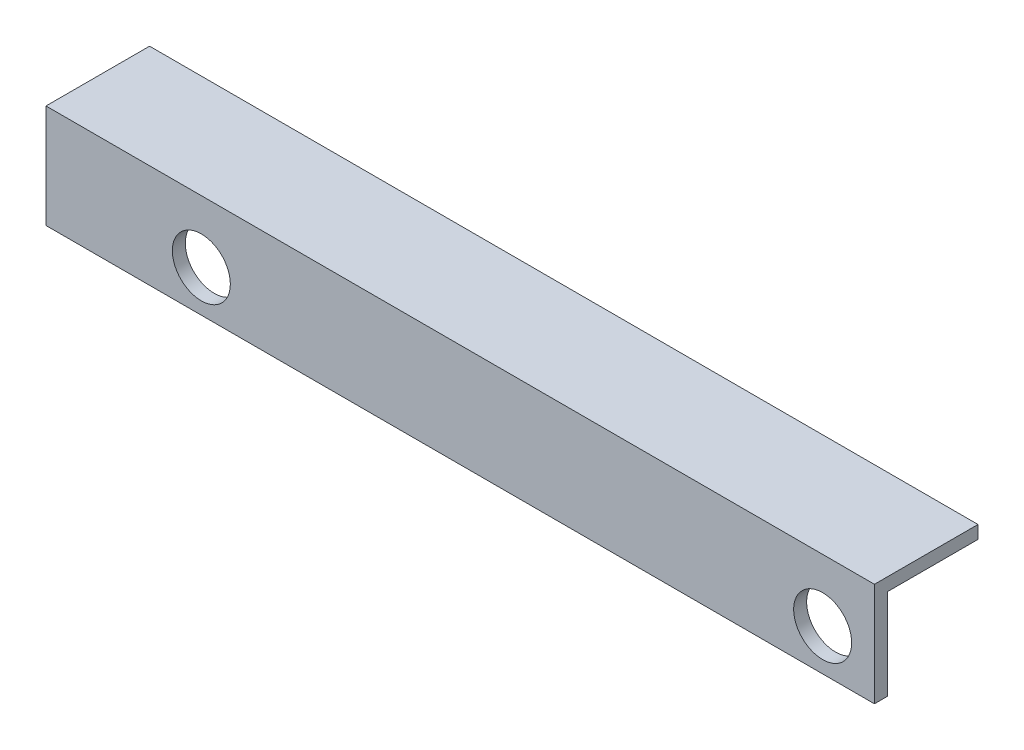
ISO-10303-21;
HEADER;
FILE_DESCRIPTION(('STEP AP214'),'2;1');
FILE_NAME('part.step','',(''),(''),'','','');
FILE_SCHEMA(('AUTOMOTIVE_DESIGN { 1 0 10303 214 1 1 1 1 }'));
ENDSEC;
DATA;
#1=APPLICATION_CONTEXT('core data for automotive mechanical design processes');
#2=APPLICATION_PROTOCOL_DEFINITION('international standard','automotive_design',2000,#1);
#3=PRODUCT_CONTEXT('',#1,'mechanical');
#4=PRODUCT('Part','Part','',(#3));
#5=PRODUCT_RELATED_PRODUCT_CATEGORY('part','',(#4));
#6=PRODUCT_DEFINITION_FORMATION('','',#4);
#7=PRODUCT_DEFINITION_CONTEXT('part definition',#1,'design');
#8=PRODUCT_DEFINITION('design','',#6,#7);
#9=PRODUCT_DEFINITION_SHAPE('','',#8);
#10=(LENGTH_UNIT() NAMED_UNIT(*) SI_UNIT(.MILLI.,.METRE.));
#11=(NAMED_UNIT(*) PLANE_ANGLE_UNIT() SI_UNIT($,.RADIAN.));
#12=(NAMED_UNIT(*) SI_UNIT($,.STERADIAN.) SOLID_ANGLE_UNIT());
#13=UNCERTAINTY_MEASURE_WITH_UNIT(LENGTH_MEASURE(1.E-05),#10,'distance_accuracy_value','');
#14=(GEOMETRIC_REPRESENTATION_CONTEXT(3) GLOBAL_UNCERTAINTY_ASSIGNED_CONTEXT((#13)) GLOBAL_UNIT_ASSIGNED_CONTEXT((#10,
#11,#12)) REPRESENTATION_CONTEXT('',''));
#15=CARTESIAN_POINT('',(0.,0.,0.));
#16=DIRECTION('',(0.,0.,1.));
#17=DIRECTION('',(1.,0.,0.));
#18=AXIS2_PLACEMENT_3D('',#15,#16,#17);
#19=CARTESIAN_POINT('',(-57.15,0.,0.));
#20=DIRECTION('',(0.,-1.,0.));
#21=DIRECTION('',(0.,0.,-1.));
#22=AXIS2_PLACEMENT_3D('',#19,#20,#21);
#23=PLANE('',#22);
#24=DIRECTION('',(1.,0.,0.));
#25=VECTOR('',#24,1.);
#26=CARTESIAN_POINT('',(-57.15,0.,-1.5875));
#27=LINE('',#26,#25);
#28=CARTESIAN_POINT('',(-57.15,0.,-1.5875));
#29=VERTEX_POINT('',#28);
#30=CARTESIAN_POINT('',(44.45,0.,-1.5875));
#31=VERTEX_POINT('',#30);
#32=EDGE_CURVE('E88',#29,#31,#27,.T.);
#33=ORIENTED_EDGE('',*,*,#32,.T.);
#34=DIRECTION('',(0.,0.,-1.));
#35=VECTOR('',#34,1.);
#36=CARTESIAN_POINT('',(44.45,0.,0.));
#37=LINE('',#36,#35);
#38=CARTESIAN_POINT('',(44.45,0.,0.));
#39=VERTEX_POINT('',#38);
#40=EDGE_CURVE('E91',#39,#31,#37,.T.);
#41=ORIENTED_EDGE('',*,*,#40,.F.);
#42=DIRECTION('',(1.,0.,0.));
#43=VECTOR('',#42,1.);
#44=CARTESIAN_POINT('',(-57.15,0.,0.));
#45=LINE('',#44,#43);
#46=CARTESIAN_POINT('',(-57.15,0.,0.));
#47=VERTEX_POINT('',#46);
#48=EDGE_CURVE('E11',#47,#39,#45,.T.);
#49=ORIENTED_EDGE('',*,*,#48,.F.);
#50=DIRECTION('',(0.,0.,-1.));
#51=VECTOR('',#50,1.);
#52=CARTESIAN_POINT('',(-57.15,0.,0.));
#53=LINE('',#52,#51);
#54=EDGE_CURVE('E92',#47,#29,#53,.T.);
#55=ORIENTED_EDGE('',*,*,#54,.T.);
#56=EDGE_LOOP('',(#33,#41,#49,#55));
#57=FACE_BOUND('',#56,.T.);
#58=ADVANCED_FACE('F38',(#57),#23,.T.);
#59=CARTESIAN_POINT('',(-57.15,0.,0.));
#60=DIRECTION('',(0.,0.,1.));
#61=DIRECTION('',(1.,0.,0.));
#62=AXIS2_PLACEMENT_3D('',#59,#60,#61);
#63=PLANE('',#62);
#64=CARTESIAN_POINT('',(-38.1,5.08,0.));
#65=DIRECTION('',(0.,0.,1.));
#66=DIRECTION('',(1.,0.,0.));
#67=AXIS2_PLACEMENT_3D('',#64,#65,#66);
#68=CIRCLE('',#67,3.556);
#69=CARTESIAN_POINT('',(-34.544,5.08,0.));
#70=VERTEX_POINT('',#69);
#71=EDGE_CURVE('E143',#70,#70,#68,.T.);
#72=ORIENTED_EDGE('',*,*,#71,.F.);
#73=EDGE_LOOP('',(#72));
#74=FACE_BOUND('',#73,.T.);
#75=CARTESIAN_POINT('',(38.1,5.08,0.));
#76=DIRECTION('',(0.,0.,1.));
#77=DIRECTION('',(1.,0.,0.));
#78=AXIS2_PLACEMENT_3D('',#75,#76,#77);
#79=CIRCLE('',#78,3.556);
#80=CARTESIAN_POINT('',(41.656,5.08,0.));
#81=VERTEX_POINT('',#80);
#82=EDGE_CURVE('E115',#81,#81,#79,.T.);
#83=ORIENTED_EDGE('',*,*,#82,.F.);
#84=EDGE_LOOP('',(#83));
#85=FACE_BOUND('',#84,.T.);
#86=ORIENTED_EDGE('',*,*,#48,.T.);
#87=DIRECTION('',(0.,-1.,0.));
#88=VECTOR('',#87,1.);
#89=CARTESIAN_POINT('',(44.45,0.,0.));
#90=LINE('',#89,#88);
#91=CARTESIAN_POINT('',(44.45,12.7,0.));
#92=VERTEX_POINT('',#91);
#93=EDGE_CURVE('E110',#92,#39,#90,.T.);
#94=ORIENTED_EDGE('',*,*,#93,.F.);
#95=DIRECTION('',(1.,0.,0.));
#96=VECTOR('',#95,1.);
#97=CARTESIAN_POINT('',(-57.15,12.7,0.));
#98=LINE('',#97,#96);
#99=CARTESIAN_POINT('',(-57.15,12.7,0.));
#100=VERTEX_POINT('',#99);
#101=EDGE_CURVE('E46',#100,#92,#98,.T.);
#102=ORIENTED_EDGE('',*,*,#101,.F.);
#103=DIRECTION('',(0.,-1.,0.));
#104=VECTOR('',#103,1.);
#105=CARTESIAN_POINT('',(-57.15,0.,0.));
#106=LINE('',#105,#104);
#107=EDGE_CURVE('E97',#100,#47,#106,.T.);
#108=ORIENTED_EDGE('',*,*,#107,.T.);
#109=EDGE_LOOP('',(#86,#94,#102,#108));
#110=FACE_BOUND('',#109,.T.);
#111=ADVANCED_FACE('F154',(#74,#85,#110),#63,.T.);
#112=CARTESIAN_POINT('',(-57.15,12.7,0.));
#113=DIRECTION('',(0.,1.,0.));
#114=DIRECTION('',(0.,0.,1.));
#115=AXIS2_PLACEMENT_3D('',#112,#113,#114);
#116=PLANE('',#115);
#117=ORIENTED_EDGE('',*,*,#101,.T.);
#118=DIRECTION('',(0.,0.,1.));
#119=VECTOR('',#118,1.);
#120=CARTESIAN_POINT('',(44.45,12.7,0.));
#121=LINE('',#120,#119);
#122=CARTESIAN_POINT('',(44.45,12.7,-12.7));
#123=VERTEX_POINT('',#122);
#124=EDGE_CURVE('E122',#123,#92,#121,.T.);
#125=ORIENTED_EDGE('',*,*,#124,.F.);
#126=DIRECTION('',(1.,0.,0.));
#127=VECTOR('',#126,1.);
#128=CARTESIAN_POINT('',(-57.15,12.7,-12.7));
#129=LINE('',#128,#127);
#130=CARTESIAN_POINT('',(-57.15,12.7,-12.7));
#131=VERTEX_POINT('',#130);
#132=EDGE_CURVE('E138',#131,#123,#129,.T.);
#133=ORIENTED_EDGE('',*,*,#132,.F.);
#134=DIRECTION('',(0.,0.,1.));
#135=VECTOR('',#134,1.);
#136=CARTESIAN_POINT('',(-57.15,12.7,0.));
#137=LINE('',#136,#135);
#138=EDGE_CURVE('E134',#131,#100,#137,.T.);
#139=ORIENTED_EDGE('',*,*,#138,.T.);
#140=EDGE_LOOP('',(#117,#125,#133,#139));
#141=FACE_BOUND('',#140,.T.);
#142=ADVANCED_FACE('F156',(#141),#116,.T.);
#143=CARTESIAN_POINT('',(-57.15,12.7,-12.7));
#144=DIRECTION('',(0.,0.,-1.));
#145=DIRECTION('',(-1.,0.,0.));
#146=AXIS2_PLACEMENT_3D('',#143,#144,#145);
#147=PLANE('',#146);
#148=ORIENTED_EDGE('',*,*,#132,.T.);
#149=DIRECTION('',(0.,1.,0.));
#150=VECTOR('',#149,1.);
#151=CARTESIAN_POINT('',(44.45,12.7,-12.7));
#152=LINE('',#151,#150);
#153=CARTESIAN_POINT('',(44.45,11.1125,-12.7));
#154=VERTEX_POINT('',#153);
#155=EDGE_CURVE('E119',#154,#123,#152,.T.);
#156=ORIENTED_EDGE('',*,*,#155,.F.);
#157=DIRECTION('',(1.,0.,0.));
#158=VECTOR('',#157,1.);
#159=CARTESIAN_POINT('',(-57.15,11.1125,-12.7));
#160=LINE('',#159,#158);
#161=CARTESIAN_POINT('',(-57.15,11.1125,-12.7));
#162=VERTEX_POINT('',#161);
#163=EDGE_CURVE('E140',#162,#154,#160,.T.);
#164=ORIENTED_EDGE('',*,*,#163,.F.);
#165=DIRECTION('',(0.,1.,0.));
#166=VECTOR('',#165,1.);
#167=CARTESIAN_POINT('',(-57.15,12.7,-12.7));
#168=LINE('',#167,#166);
#169=EDGE_CURVE('E131',#162,#131,#168,.T.);
#170=ORIENTED_EDGE('',*,*,#169,.T.);
#171=EDGE_LOOP('',(#148,#156,#164,#170));
#172=FACE_BOUND('',#171,.T.);
#173=ADVANCED_FACE('F170',(#172),#147,.T.);
#174=CARTESIAN_POINT('',(-57.15,11.1125,-1.5875));
#175=DIRECTION('',(0.,-1.,0.));
#176=DIRECTION('',(0.,0.,-1.));
#177=AXIS2_PLACEMENT_3D('',#174,#175,#176);
#178=PLANE('',#177);
#179=ORIENTED_EDGE('',*,*,#163,.T.);
#180=DIRECTION('',(0.,0.,-1.));
#181=VECTOR('',#180,1.);
#182=CARTESIAN_POINT('',(44.45,11.1125,-1.5875));
#183=LINE('',#182,#181);
#184=CARTESIAN_POINT('',(44.45,11.1125,-1.5875));
#185=VERTEX_POINT('',#184);
#186=EDGE_CURVE('E105',#185,#154,#183,.T.);
#187=ORIENTED_EDGE('',*,*,#186,.F.);
#188=DIRECTION('',(1.,0.,0.));
#189=VECTOR('',#188,1.);
#190=CARTESIAN_POINT('',(-57.15,11.1125,-1.5875));
#191=LINE('',#190,#189);
#192=CARTESIAN_POINT('',(-57.15,11.1125,-1.5875));
#193=VERTEX_POINT('',#192);
#194=EDGE_CURVE('E96',#193,#185,#191,.T.);
#195=ORIENTED_EDGE('',*,*,#194,.F.);
#196=DIRECTION('',(0.,0.,-1.));
#197=VECTOR('',#196,1.);
#198=CARTESIAN_POINT('',(-57.15,11.1125,-1.5875));
#199=LINE('',#198,#197);
#200=EDGE_CURVE('E128',#193,#162,#199,.T.);
#201=ORIENTED_EDGE('',*,*,#200,.T.);
#202=EDGE_LOOP('',(#179,#187,#195,#201));
#203=FACE_BOUND('',#202,.T.);
#204=ADVANCED_FACE('F166',(#203),#178,.T.);
#205=CARTESIAN_POINT('',(-57.15,0.,-1.5875));
#206=DIRECTION('',(0.,0.,-1.));
#207=DIRECTION('',(-1.,0.,0.));
#208=AXIS2_PLACEMENT_3D('',#205,#206,#207);
#209=PLANE('',#208);
#210=CARTESIAN_POINT('',(-38.1,5.08,-1.5875));
#211=DIRECTION('',(0.,0.,-1.));
#212=DIRECTION('',(-1.,0.,0.));
#213=AXIS2_PLACEMENT_3D('',#210,#211,#212);
#214=CIRCLE('',#213,3.556);
#215=CARTESIAN_POINT('',(-41.656,5.08,-1.5875));
#216=VERTEX_POINT('',#215);
#217=EDGE_CURVE('E41',#216,#216,#214,.T.);
#218=ORIENTED_EDGE('',*,*,#217,.F.);
#219=EDGE_LOOP('',(#218));
#220=FACE_BOUND('',#219,.T.);
#221=CARTESIAN_POINT('',(38.1,5.08,-1.5875));
#222=DIRECTION('',(0.,0.,-1.));
#223=DIRECTION('',(-1.,0.,0.));
#224=AXIS2_PLACEMENT_3D('',#221,#222,#223);
#225=CIRCLE('',#224,3.556);
#226=CARTESIAN_POINT('',(34.544,5.08,-1.5875));
#227=VERTEX_POINT('',#226);
#228=EDGE_CURVE('E113',#227,#227,#225,.T.);
#229=ORIENTED_EDGE('',*,*,#228,.F.);
#230=EDGE_LOOP('',(#229));
#231=FACE_BOUND('',#230,.T.);
#232=ORIENTED_EDGE('',*,*,#194,.T.);
#233=DIRECTION('',(0.,1.,0.));
#234=VECTOR('',#233,1.);
#235=CARTESIAN_POINT('',(44.45,0.,-1.5875));
#236=LINE('',#235,#234);
#237=EDGE_CURVE('E100',#31,#185,#236,.T.);
#238=ORIENTED_EDGE('',*,*,#237,.F.);
#239=ORIENTED_EDGE('',*,*,#32,.F.);
#240=DIRECTION('',(0.,1.,0.));
#241=VECTOR('',#240,1.);
#242=CARTESIAN_POINT('',(-57.15,0.,-1.5875));
#243=LINE('',#242,#241);
#244=EDGE_CURVE('E126',#29,#193,#243,.T.);
#245=ORIENTED_EDGE('',*,*,#244,.T.);
#246=EDGE_LOOP('',(#232,#238,#239,#245));
#247=FACE_BOUND('',#246,.T.);
#248=ADVANCED_FACE('F101',(#220,#231,#247),#209,.T.);
#249=CARTESIAN_POINT('',(-57.15,0.,0.));
#250=DIRECTION('',(1.,0.,0.));
#251=DIRECTION('',(0.,0.,-1.));
#252=AXIS2_PLACEMENT_3D('',#249,#250,#251);
#253=PLANE('',#252);
#254=ORIENTED_EDGE('',*,*,#54,.F.);
#255=ORIENTED_EDGE('',*,*,#107,.F.);
#256=ORIENTED_EDGE('',*,*,#138,.F.);
#257=ORIENTED_EDGE('',*,*,#169,.F.);
#258=ORIENTED_EDGE('',*,*,#200,.F.);
#259=ORIENTED_EDGE('',*,*,#244,.F.);
#260=EDGE_LOOP('',(#254,#255,#256,#257,#258,#259));
#261=FACE_BOUND('',#260,.T.);
#262=ADVANCED_FACE('F162',(#261),#253,.F.);
#263=CARTESIAN_POINT('',(44.45,0.,0.));
#264=DIRECTION('',(1.,0.,0.));
#265=DIRECTION('',(0.,0.,-1.));
#266=AXIS2_PLACEMENT_3D('',#263,#264,#265);
#267=PLANE('',#266);
#268=ORIENTED_EDGE('',*,*,#40,.T.);
#269=ORIENTED_EDGE('',*,*,#237,.T.);
#270=ORIENTED_EDGE('',*,*,#186,.T.);
#271=ORIENTED_EDGE('',*,*,#155,.T.);
#272=ORIENTED_EDGE('',*,*,#124,.T.);
#273=ORIENTED_EDGE('',*,*,#93,.T.);
#274=EDGE_LOOP('',(#268,#269,#270,#271,#272,#273));
#275=FACE_BOUND('',#274,.T.);
#276=ADVANCED_FACE('F108',(#275),#267,.T.);
#277=CARTESIAN_POINT('',(38.1,5.08,-12.7));
#278=DIRECTION('',(0.,0.,1.));
#279=DIRECTION('',(1.,0.,0.));
#280=AXIS2_PLACEMENT_3D('',#277,#278,#279);
#281=CYLINDRICAL_SURFACE('',#280,3.556);
#282=ORIENTED_EDGE('',*,*,#228,.T.);
#283=EDGE_LOOP('',(#282));
#284=FACE_BOUND('',#283,.T.);
#285=ORIENTED_EDGE('',*,*,#82,.T.);
#286=EDGE_LOOP('',(#285));
#287=FACE_BOUND('',#286,.T.);
#288=ADVANCED_FACE('F152',(#284,#287),#281,.F.);
#289=CARTESIAN_POINT('',(-38.1,5.08,-12.7));
#290=DIRECTION('',(0.,0.,1.));
#291=DIRECTION('',(1.,0.,0.));
#292=AXIS2_PLACEMENT_3D('',#289,#290,#291);
#293=CYLINDRICAL_SURFACE('',#292,3.556);
#294=ORIENTED_EDGE('',*,*,#217,.T.);
#295=EDGE_LOOP('',(#294));
#296=FACE_BOUND('',#295,.T.);
#297=ORIENTED_EDGE('',*,*,#71,.T.);
#298=EDGE_LOOP('',(#297));
#299=FACE_BOUND('',#298,.T.);
#300=ADVANCED_FACE('F214',(#296,#299),#293,.F.);
#301=CLOSED_SHELL('',(#58,#111,#142,#173,#204,#248,#262,#276,#288,#300));
#302=MANIFOLD_SOLID_BREP('B2',#301);
#303=ADVANCED_BREP_SHAPE_REPRESENTATION('',(#18,#302),#14);
#304=SHAPE_DEFINITION_REPRESENTATION(#9,#303);
ENDSEC;
END-ISO-10303-21;
